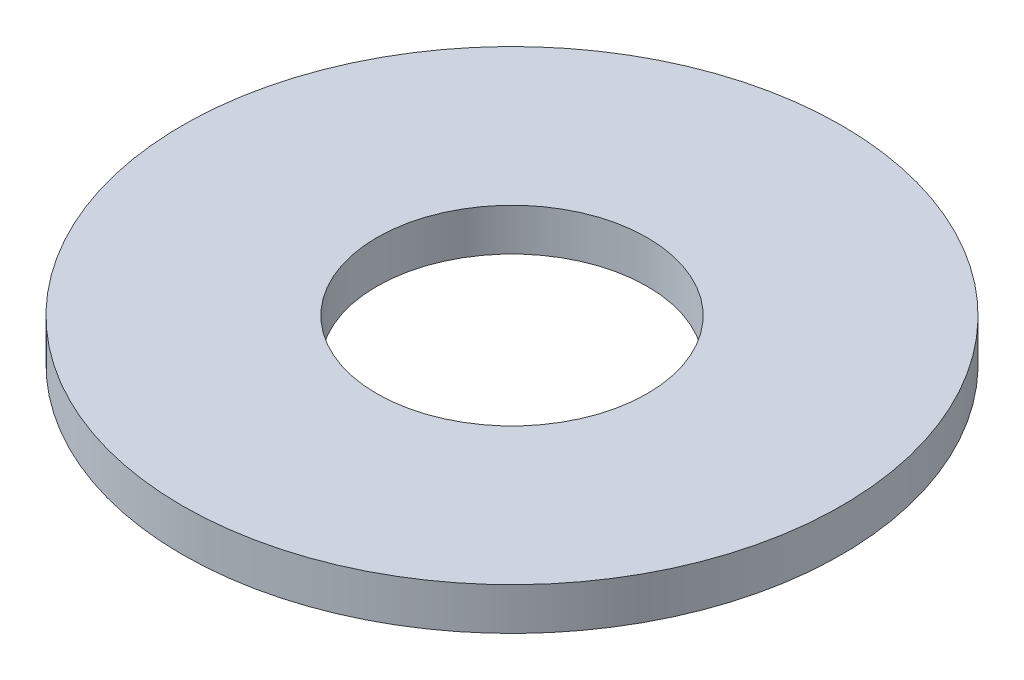
ISO-10303-21;
HEADER;
FILE_DESCRIPTION(('STEP AP214'),'2;1');
FILE_NAME('part.step','',(''),(''),'','','');
FILE_SCHEMA(('AUTOMOTIVE_DESIGN { 1 0 10303 214 1 1 1 1 }'));
ENDSEC;
DATA;
#1=APPLICATION_CONTEXT('core data for automotive mechanical design processes');
#2=APPLICATION_PROTOCOL_DEFINITION('international standard','automotive_design',2000,#1);
#3=PRODUCT_CONTEXT('',#1,'mechanical');
#4=PRODUCT('Part','Part','',(#3));
#5=PRODUCT_RELATED_PRODUCT_CATEGORY('part','',(#4));
#6=PRODUCT_DEFINITION_FORMATION('','',#4);
#7=PRODUCT_DEFINITION_CONTEXT('part definition',#1,'design');
#8=PRODUCT_DEFINITION('design','',#6,#7);
#9=PRODUCT_DEFINITION_SHAPE('','',#8);
#10=(LENGTH_UNIT() NAMED_UNIT(*) SI_UNIT(.MILLI.,.METRE.));
#11=(NAMED_UNIT(*) PLANE_ANGLE_UNIT() SI_UNIT($,.RADIAN.));
#12=(NAMED_UNIT(*) SI_UNIT($,.STERADIAN.) SOLID_ANGLE_UNIT());
#13=UNCERTAINTY_MEASURE_WITH_UNIT(LENGTH_MEASURE(1.E-05),#10,'distance_accuracy_value','');
#14=(GEOMETRIC_REPRESENTATION_CONTEXT(3) GLOBAL_UNCERTAINTY_ASSIGNED_CONTEXT((#13)) GLOBAL_UNIT_ASSIGNED_CONTEXT((#10,
#11,#12)) REPRESENTATION_CONTEXT('',''));
#15=CARTESIAN_POINT('',(0.,0.,0.));
#16=DIRECTION('',(0.,0.,1.));
#17=DIRECTION('',(1.,0.,0.));
#18=AXIS2_PLACEMENT_3D('',#15,#16,#17);
#19=CARTESIAN_POINT('',(0.,0.5,0.));
#20=DIRECTION('',(0.,1.,0.));
#21=DIRECTION('',(0.,0.,1.));
#22=AXIS2_PLACEMENT_3D('',#19,#20,#21);
#23=PLANE('',#22);
#24=CARTESIAN_POINT('',(0.,0.5,0.));
#25=DIRECTION('',(0.,1.,0.));
#26=DIRECTION('',(0.,0.,1.));
#27=AXIS2_PLACEMENT_3D('',#24,#25,#26);
#28=CIRCLE('',#27,3.9);
#29=CARTESIAN_POINT('',(0.,0.5,3.9));
#30=VERTEX_POINT('',#29);
#31=EDGE_CURVE('E10',#30,#30,#28,.T.);
#32=ORIENTED_EDGE('',*,*,#31,.T.);
#33=EDGE_LOOP('',(#32));
#34=FACE_BOUND('',#33,.T.);
#35=CARTESIAN_POINT('',(0.,0.5,0.));
#36=DIRECTION('',(0.,1.,0.));
#37=DIRECTION('',(0.,0.,1.));
#38=AXIS2_PLACEMENT_3D('',#35,#36,#37);
#39=CIRCLE('',#38,1.6);
#40=CARTESIAN_POINT('',(0.,0.5,1.6));
#41=VERTEX_POINT('',#40);
#42=EDGE_CURVE('E40',#41,#41,#39,.T.);
#43=ORIENTED_EDGE('',*,*,#42,.F.);
#44=EDGE_LOOP('',(#43));
#45=FACE_BOUND('',#44,.T.);
#46=ADVANCED_FACE('F29',(#34,#45),#23,.T.);
#47=CARTESIAN_POINT('',(0.,0.,0.));
#48=DIRECTION('',(0.,1.,0.));
#49=DIRECTION('',(0.,0.,1.));
#50=AXIS2_PLACEMENT_3D('',#47,#48,#49);
#51=PLANE('',#50);
#52=CARTESIAN_POINT('',(0.,0.,0.));
#53=DIRECTION('',(0.,1.,0.));
#54=DIRECTION('',(0.,0.,1.));
#55=AXIS2_PLACEMENT_3D('',#52,#53,#54);
#56=CIRCLE('',#55,3.9);
#57=CARTESIAN_POINT('',(0.,0.,3.9));
#58=VERTEX_POINT('',#57);
#59=EDGE_CURVE('E36',#58,#58,#56,.T.);
#60=ORIENTED_EDGE('',*,*,#59,.F.);
#61=EDGE_LOOP('',(#60));
#62=FACE_BOUND('',#61,.T.);
#63=CARTESIAN_POINT('',(0.,0.,0.));
#64=DIRECTION('',(0.,1.,0.));
#65=DIRECTION('',(0.,0.,1.));
#66=AXIS2_PLACEMENT_3D('',#63,#64,#65);
#67=CIRCLE('',#66,1.6);
#68=CARTESIAN_POINT('',(0.,0.,1.6));
#69=VERTEX_POINT('',#68);
#70=EDGE_CURVE('E44',#69,#69,#67,.T.);
#71=ORIENTED_EDGE('',*,*,#70,.T.);
#72=EDGE_LOOP('',(#71));
#73=FACE_BOUND('',#72,.T.);
#74=ADVANCED_FACE('F50',(#62,#73),#51,.F.);
#75=CARTESIAN_POINT('',(0.,0.5,0.));
#76=DIRECTION('',(0.,-1.,0.));
#77=DIRECTION('',(0.,0.,-1.));
#78=AXIS2_PLACEMENT_3D('',#75,#76,#77);
#79=CYLINDRICAL_SURFACE('',#78,3.9);
#80=ORIENTED_EDGE('',*,*,#31,.F.);
#81=EDGE_LOOP('',(#80));
#82=FACE_BOUND('',#81,.T.);
#83=ORIENTED_EDGE('',*,*,#59,.T.);
#84=EDGE_LOOP('',(#83));
#85=FACE_BOUND('',#84,.T.);
#86=ADVANCED_FACE('F31',(#82,#85),#79,.T.);
#87=CARTESIAN_POINT('',(0.,0.5,0.));
#88=DIRECTION('',(0.,-1.,0.));
#89=DIRECTION('',(0.,0.,-1.));
#90=AXIS2_PLACEMENT_3D('',#87,#88,#89);
#91=CYLINDRICAL_SURFACE('',#90,1.6);
#92=ORIENTED_EDGE('',*,*,#42,.T.);
#93=EDGE_LOOP('',(#92));
#94=FACE_BOUND('',#93,.T.);
#95=ORIENTED_EDGE('',*,*,#70,.F.);
#96=EDGE_LOOP('',(#95));
#97=FACE_BOUND('',#96,.T.);
#98=ADVANCED_FACE('F52',(#94,#97),#91,.F.);
#99=CLOSED_SHELL('',(#46,#74,#86,#98));
#100=MANIFOLD_SOLID_BREP('B2',#99);
#101=ADVANCED_BREP_SHAPE_REPRESENTATION('',(#18,#100),#14);
#102=SHAPE_DEFINITION_REPRESENTATION(#9,#101);
ENDSEC;
END-ISO-10303-21;
